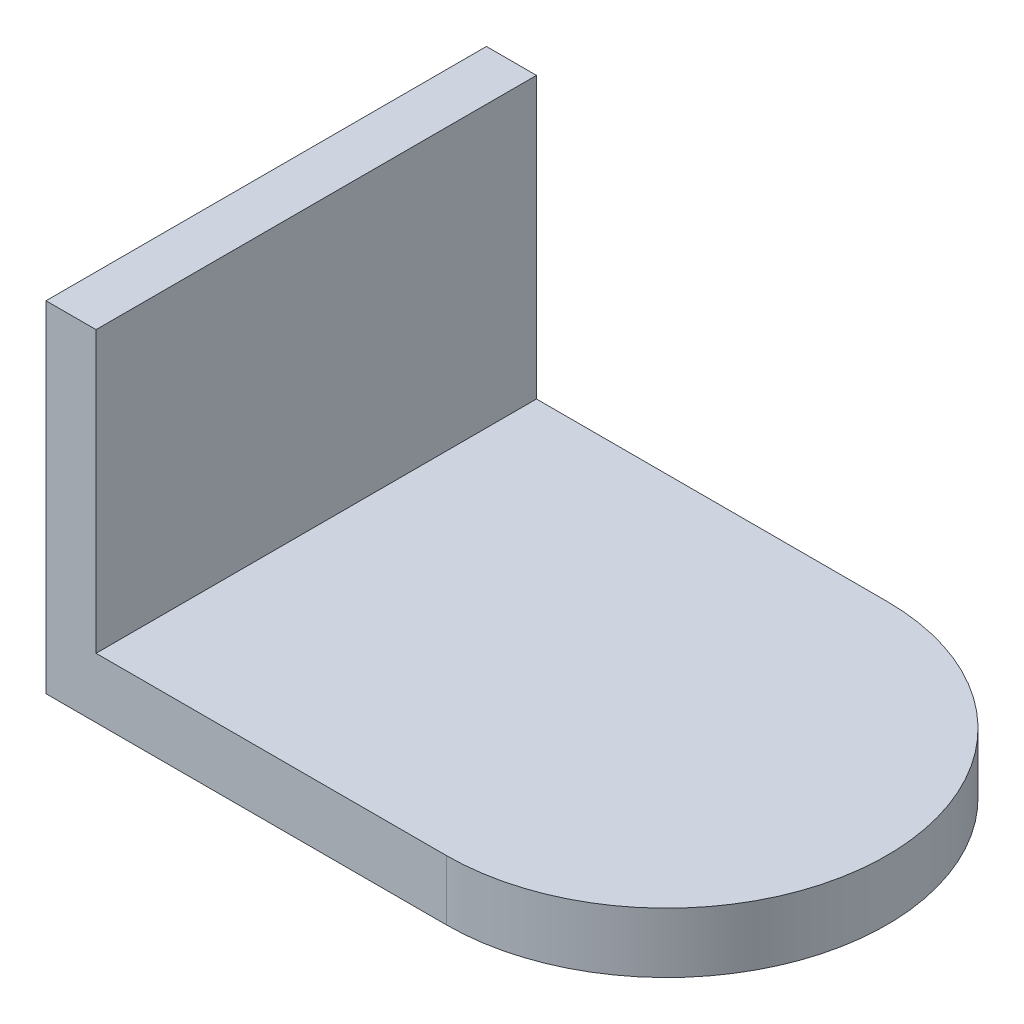
ISO-10303-21;
HEADER;
FILE_DESCRIPTION(('STEP AP214'),'2;1');
FILE_NAME('part.step','',(''),(''),'','','');
FILE_SCHEMA(('AUTOMOTIVE_DESIGN { 1 0 10303 214 1 1 1 1 }'));
ENDSEC;
DATA;
#1=APPLICATION_CONTEXT('core data for automotive mechanical design processes');
#2=APPLICATION_PROTOCOL_DEFINITION('international standard','automotive_design',2000,#1);
#3=PRODUCT_CONTEXT('',#1,'mechanical');
#4=PRODUCT('Part','Part','',(#3));
#5=PRODUCT_RELATED_PRODUCT_CATEGORY('part','',(#4));
#6=PRODUCT_DEFINITION_FORMATION('','',#4);
#7=PRODUCT_DEFINITION_CONTEXT('part definition',#1,'design');
#8=PRODUCT_DEFINITION('design','',#6,#7);
#9=PRODUCT_DEFINITION_SHAPE('','',#8);
#10=(LENGTH_UNIT() NAMED_UNIT(*) SI_UNIT(.MILLI.,.METRE.));
#11=(NAMED_UNIT(*) PLANE_ANGLE_UNIT() SI_UNIT($,.RADIAN.));
#12=(NAMED_UNIT(*) SI_UNIT($,.STERADIAN.) SOLID_ANGLE_UNIT());
#13=UNCERTAINTY_MEASURE_WITH_UNIT(LENGTH_MEASURE(1.E-05),#10,'distance_accuracy_value','');
#14=(GEOMETRIC_REPRESENTATION_CONTEXT(3) GLOBAL_UNCERTAINTY_ASSIGNED_CONTEXT((#13)) GLOBAL_UNIT_ASSIGNED_CONTEXT((#10,
#11,#12)) REPRESENTATION_CONTEXT('',''));
#15=CARTESIAN_POINT('',(0.,0.,0.));
#16=DIRECTION('',(0.,0.,1.));
#17=DIRECTION('',(1.,0.,0.));
#18=AXIS2_PLACEMENT_3D('',#15,#16,#17);
#19=CARTESIAN_POINT('',(6.,3.,0.));
#20=DIRECTION('',(0.,-1.,0.));
#21=DIRECTION('',(0.,0.,-1.));
#22=AXIS2_PLACEMENT_3D('',#19,#20,#21);
#23=CYLINDRICAL_SURFACE('',#22,11.);
#24=DIRECTION('',(0.,1.,0.));
#25=VECTOR('',#24,1.);
#26=CARTESIAN_POINT('',(6.,4.5,-11.));
#27=LINE('',#26,#25);
#28=CARTESIAN_POINT('',(6.,0.,-11.));
#29=VERTEX_POINT('',#28);
#30=CARTESIAN_POINT('',(6.,3.,-11.));
#31=VERTEX_POINT('',#30);
#32=EDGE_CURVE('E89',#29,#31,#27,.T.);
#33=ORIENTED_EDGE('',*,*,#32,.T.);
#34=CARTESIAN_POINT('',(6.,3.,0.));
#35=DIRECTION('',(0.,-1.,0.));
#36=DIRECTION('',(0.,0.,-1.));
#37=AXIS2_PLACEMENT_3D('',#34,#35,#36);
#38=CIRCLE('',#37,11.);
#39=CARTESIAN_POINT('',(6.,3.,11.));
#40=VERTEX_POINT('',#39);
#41=EDGE_CURVE('E120',#40,#31,#38,.F.);
#42=ORIENTED_EDGE('',*,*,#41,.F.);
#43=DIRECTION('',(0.,-1.,0.));
#44=VECTOR('',#43,1.);
#45=CARTESIAN_POINT('',(6.,4.5,11.));
#46=LINE('',#45,#44);
#47=CARTESIAN_POINT('',(6.,0.,11.));
#48=VERTEX_POINT('',#47);
#49=EDGE_CURVE('E106',#40,#48,#46,.T.);
#50=ORIENTED_EDGE('',*,*,#49,.T.);
#51=CARTESIAN_POINT('',(6.,0.,0.));
#52=DIRECTION('',(0.,-1.,0.));
#53=DIRECTION('',(0.,0.,-1.));
#54=AXIS2_PLACEMENT_3D('',#51,#52,#53);
#55=CIRCLE('',#54,11.);
#56=EDGE_CURVE('E104',#48,#29,#55,.F.);
#57=ORIENTED_EDGE('',*,*,#56,.T.);
#58=EDGE_LOOP('',(#33,#42,#50,#57));
#59=FACE_BOUND('',#58,.T.);
#60=ADVANCED_FACE('F44',(#59),#23,.T.);
#61=CARTESIAN_POINT('',(-14.,0.,-11.));
#62=DIRECTION('',(0.,1.,0.));
#63=DIRECTION('',(0.,0.,1.));
#64=AXIS2_PLACEMENT_3D('',#61,#62,#63);
#65=PLANE('',#64);
#66=DIRECTION('',(0.,0.,-1.));
#67=VECTOR('',#66,1.);
#68=CARTESIAN_POINT('',(-14.,0.,0.));
#69=LINE('',#68,#67);
#70=CARTESIAN_POINT('',(-14.,0.,11.));
#71=VERTEX_POINT('',#70);
#72=CARTESIAN_POINT('',(-14.,0.,-11.));
#73=VERTEX_POINT('',#72);
#74=EDGE_CURVE('E12',#71,#73,#69,.T.);
#75=ORIENTED_EDGE('',*,*,#74,.T.);
#76=DIRECTION('',(1.,0.,0.));
#77=VECTOR('',#76,1.);
#78=CARTESIAN_POINT('',(-4.,0.,-11.));
#79=LINE('',#78,#77);
#80=EDGE_CURVE('E95',#73,#29,#79,.T.);
#81=ORIENTED_EDGE('',*,*,#80,.T.);
#82=ORIENTED_EDGE('',*,*,#56,.F.);
#83=DIRECTION('',(-1.,0.,0.));
#84=VECTOR('',#83,1.);
#85=CARTESIAN_POINT('',(-4.,0.,11.));
#86=LINE('',#85,#84);
#87=EDGE_CURVE('E101',#48,#71,#86,.T.);
#88=ORIENTED_EDGE('',*,*,#87,.T.);
#89=EDGE_LOOP('',(#75,#81,#82,#88));
#90=FACE_BOUND('',#89,.T.);
#91=ADVANCED_FACE('F111',(#90),#65,.F.);
#92=CARTESIAN_POINT('',(6.,0.,11.));
#93=DIRECTION('',(0.,0.,-1.));
#94=DIRECTION('',(-1.,0.,0.));
#95=AXIS2_PLACEMENT_3D('',#92,#93,#94);
#96=PLANE('',#95);
#97=DIRECTION('',(0.,-1.,0.));
#98=VECTOR('',#97,1.);
#99=CARTESIAN_POINT('',(-14.,4.5,11.));
#100=LINE('',#99,#98);
#101=CARTESIAN_POINT('',(-14.,17.,11.));
#102=VERTEX_POINT('',#101);
#103=EDGE_CURVE('E54',#102,#71,#100,.T.);
#104=ORIENTED_EDGE('',*,*,#103,.T.);
#105=ORIENTED_EDGE('',*,*,#87,.F.);
#106=ORIENTED_EDGE('',*,*,#49,.F.);
#107=DIRECTION('',(1.,0.,0.));
#108=VECTOR('',#107,1.);
#109=CARTESIAN_POINT('',(2.8355,3.,11.));
#110=LINE('',#109,#108);
#111=CARTESIAN_POINT('',(-11.5,3.,11.));
#112=VERTEX_POINT('',#111);
#113=EDGE_CURVE('E114',#112,#40,#110,.T.);
#114=ORIENTED_EDGE('',*,*,#113,.F.);
#115=DIRECTION('',(0.,-1.,0.));
#116=VECTOR('',#115,1.);
#117=CARTESIAN_POINT('',(-11.5,17.,11.));
#118=LINE('',#117,#116);
#119=CARTESIAN_POINT('',(-11.5,17.,11.));
#120=VERTEX_POINT('',#119);
#121=EDGE_CURVE('E882',#120,#112,#118,.T.);
#122=ORIENTED_EDGE('',*,*,#121,.F.);
#123=DIRECTION('',(1.,0.,0.));
#124=VECTOR('',#123,1.);
#125=CARTESIAN_POINT('',(-11.5,17.,11.));
#126=LINE('',#125,#124);
#127=EDGE_CURVE('E888',#102,#120,#126,.T.);
#128=ORIENTED_EDGE('',*,*,#127,.F.);
#129=EDGE_LOOP('',(#104,#105,#106,#114,#122,#128));
#130=FACE_BOUND('',#129,.T.);
#131=ADVANCED_FACE('F277',(#130),#96,.F.);
#132=CARTESIAN_POINT('',(-14.,0.,-11.));
#133=DIRECTION('',(0.,0.,1.));
#134=DIRECTION('',(1.,0.,0.));
#135=AXIS2_PLACEMENT_3D('',#132,#133,#134);
#136=PLANE('',#135);
#137=DIRECTION('',(0.,-1.,0.));
#138=VECTOR('',#137,1.);
#139=CARTESIAN_POINT('',(-11.5,17.,-11.));
#140=LINE('',#139,#138);
#141=CARTESIAN_POINT('',(-11.5,17.,-11.));
#142=VERTEX_POINT('',#141);
#143=CARTESIAN_POINT('',(-11.5,3.,-11.));
#144=VERTEX_POINT('',#143);
#145=EDGE_CURVE('E109',#142,#144,#140,.T.);
#146=ORIENTED_EDGE('',*,*,#145,.T.);
#147=DIRECTION('',(-1.,0.,0.));
#148=VECTOR('',#147,1.);
#149=CARTESIAN_POINT('',(2.8355,3.,-11.));
#150=LINE('',#149,#148);
#151=EDGE_CURVE('E97',#31,#144,#150,.T.);
#152=ORIENTED_EDGE('',*,*,#151,.F.);
#153=ORIENTED_EDGE('',*,*,#32,.F.);
#154=ORIENTED_EDGE('',*,*,#80,.F.);
#155=DIRECTION('',(0.,1.,0.));
#156=VECTOR('',#155,1.);
#157=CARTESIAN_POINT('',(-14.,4.5,-11.));
#158=LINE('',#157,#156);
#159=CARTESIAN_POINT('',(-14.,17.,-11.));
#160=VERTEX_POINT('',#159);
#161=EDGE_CURVE('E127',#73,#160,#158,.T.);
#162=ORIENTED_EDGE('',*,*,#161,.T.);
#163=DIRECTION('',(-1.,0.,0.));
#164=VECTOR('',#163,1.);
#165=CARTESIAN_POINT('',(-14.,17.,-11.));
#166=LINE('',#165,#164);
#167=EDGE_CURVE('E898',#142,#160,#166,.T.);
#168=ORIENTED_EDGE('',*,*,#167,.F.);
#169=EDGE_LOOP('',(#146,#152,#153,#154,#162,#168));
#170=FACE_BOUND('',#169,.T.);
#171=ADVANCED_FACE('F92',(#170),#136,.F.);
#172=CARTESIAN_POINT('',(-11.5,3.,-11.));
#173=DIRECTION('',(0.,1.,0.));
#174=DIRECTION('',(0.,0.,1.));
#175=AXIS2_PLACEMENT_3D('',#172,#173,#174);
#176=PLANE('',#175);
#177=DIRECTION('',(0.,0.,-1.));
#178=VECTOR('',#177,1.);
#179=CARTESIAN_POINT('',(-11.5,3.,-11.));
#180=LINE('',#179,#178);
#181=EDGE_CURVE('E62',#112,#144,#180,.T.);
#182=ORIENTED_EDGE('',*,*,#181,.F.);
#183=ORIENTED_EDGE('',*,*,#113,.T.);
#184=ORIENTED_EDGE('',*,*,#41,.T.);
#185=ORIENTED_EDGE('',*,*,#151,.T.);
#186=EDGE_LOOP('',(#182,#183,#184,#185));
#187=FACE_BOUND('',#186,.T.);
#188=ADVANCED_FACE('F300',(#187),#176,.T.);
#189=CARTESIAN_POINT('',(-14.,0.,11.));
#190=DIRECTION('',(1.,0.,0.));
#191=DIRECTION('',(0.,0.,-1.));
#192=AXIS2_PLACEMENT_3D('',#189,#190,#191);
#193=PLANE('',#192);
#194=DIRECTION('',(0.,0.,1.));
#195=VECTOR('',#194,1.);
#196=CARTESIAN_POINT('',(-14.,17.,11.));
#197=LINE('',#196,#195);
#198=EDGE_CURVE('E890',#160,#102,#197,.T.);
#199=ORIENTED_EDGE('',*,*,#198,.F.);
#200=ORIENTED_EDGE('',*,*,#161,.F.);
#201=ORIENTED_EDGE('',*,*,#74,.F.);
#202=ORIENTED_EDGE('',*,*,#103,.F.);
#203=EDGE_LOOP('',(#199,#200,#201,#202));
#204=FACE_BOUND('',#203,.T.);
#205=ADVANCED_FACE('F46',(#204),#193,.F.);
#206=CARTESIAN_POINT('',(-11.5,17.,-11.));
#207=DIRECTION('',(-1.,0.,0.));
#208=DIRECTION('',(0.,0.,1.));
#209=AXIS2_PLACEMENT_3D('',#206,#207,#208);
#210=PLANE('',#209);
#211=ORIENTED_EDGE('',*,*,#181,.T.);
#212=ORIENTED_EDGE('',*,*,#145,.F.);
#213=DIRECTION('',(0.,0.,-1.));
#214=VECTOR('',#213,1.);
#215=CARTESIAN_POINT('',(-11.5,17.,-11.));
#216=LINE('',#215,#214);
#217=EDGE_CURVE('E887',#120,#142,#216,.T.);
#218=ORIENTED_EDGE('',*,*,#217,.F.);
#219=ORIENTED_EDGE('',*,*,#121,.T.);
#220=EDGE_LOOP('',(#211,#212,#218,#219));
#221=FACE_BOUND('',#220,.T.);
#222=ADVANCED_FACE('F264',(#221),#210,.F.);
#223=CARTESIAN_POINT('',(0.,17.,0.));
#224=DIRECTION('',(0.,-1.,0.));
#225=DIRECTION('',(0.,0.,-1.));
#226=AXIS2_PLACEMENT_3D('',#223,#224,#225);
#227=PLANE('',#226);
#228=ORIENTED_EDGE('',*,*,#217,.T.);
#229=ORIENTED_EDGE('',*,*,#167,.T.);
#230=ORIENTED_EDGE('',*,*,#198,.T.);
#231=ORIENTED_EDGE('',*,*,#127,.T.);
#232=EDGE_LOOP('',(#228,#229,#230,#231));
#233=FACE_BOUND('',#232,.T.);
#234=ADVANCED_FACE('F903',(#233),#227,.F.);
#235=CLOSED_SHELL('',(#60,#91,#131,#171,#188,#205,#222,#234));
#236=MANIFOLD_SOLID_BREP('B2',#235);
#237=ADVANCED_BREP_SHAPE_REPRESENTATION('',(#18,#236),#14);
#238=SHAPE_DEFINITION_REPRESENTATION(#9,#237);
ENDSEC;
END-ISO-10303-21;
